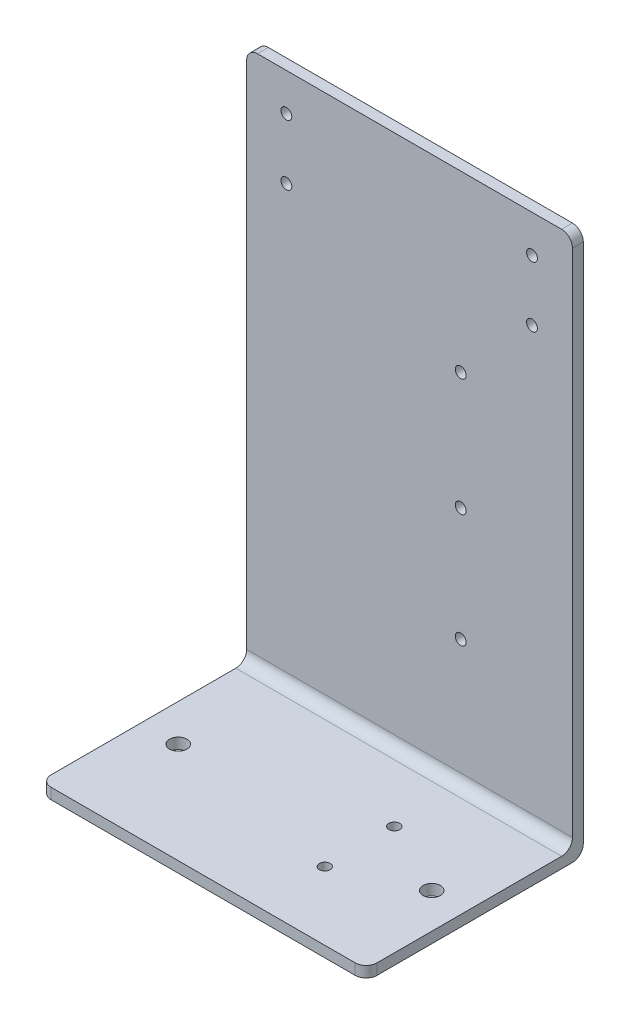
ISO-10303-21;
HEADER;
FILE_DESCRIPTION(('STEP AP214'),'2;1');
FILE_NAME('part.step','',(''),(''),'','','');
FILE_SCHEMA(('AUTOMOTIVE_DESIGN { 1 0 10303 214 1 1 1 1 }'));
ENDSEC;
DATA;
#1=APPLICATION_CONTEXT('core data for automotive mechanical design processes');
#2=APPLICATION_PROTOCOL_DEFINITION('international standard','automotive_design',2000,#1);
#3=PRODUCT_CONTEXT('',#1,'mechanical');
#4=PRODUCT('Part','Part','',(#3));
#5=PRODUCT_RELATED_PRODUCT_CATEGORY('part','',(#4));
#6=PRODUCT_DEFINITION_FORMATION('','',#4);
#7=PRODUCT_DEFINITION_CONTEXT('part definition',#1,'design');
#8=PRODUCT_DEFINITION('design','',#6,#7);
#9=PRODUCT_DEFINITION_SHAPE('','',#8);
#10=(LENGTH_UNIT() NAMED_UNIT(*) SI_UNIT(.MILLI.,.METRE.));
#11=(NAMED_UNIT(*) PLANE_ANGLE_UNIT() SI_UNIT($,.RADIAN.));
#12=(NAMED_UNIT(*) SI_UNIT($,.STERADIAN.) SOLID_ANGLE_UNIT());
#13=UNCERTAINTY_MEASURE_WITH_UNIT(LENGTH_MEASURE(1.E-05),#10,'distance_accuracy_value','');
#14=(GEOMETRIC_REPRESENTATION_CONTEXT(3) GLOBAL_UNCERTAINTY_ASSIGNED_CONTEXT((#13)) GLOBAL_UNIT_ASSIGNED_CONTEXT((#10,
#11,#12)) REPRESENTATION_CONTEXT('',''));
#15=CARTESIAN_POINT('',(0.,0.,0.));
#16=DIRECTION('',(0.,0.,1.));
#17=DIRECTION('',(1.,0.,0.));
#18=AXIS2_PLACEMENT_3D('',#15,#16,#17);
#19=CARTESIAN_POINT('',(-300.,10.,0.));
#20=DIRECTION('',(0.,-1.,0.));
#21=DIRECTION('',(0.,0.,-1.));
#22=AXIS2_PLACEMENT_3D('',#19,#20,#21);
#23=PLANE('',#22);
#24=CARTESIAN_POINT('',(-32.5315013173715,10.,107.072710653668));
#25=DIRECTION('',(0.,1.,0.));
#26=DIRECTION('',(0.,0.,1.));
#27=AXIS2_PLACEMENT_3D('',#24,#25,#26);
#28=CIRCLE('',#27,8.);
#29=CARTESIAN_POINT('',(-32.5315013173715,10.,115.072710653668));
#30=VERTEX_POINT('',#29);
#31=EDGE_CURVE('E426',#30,#30,#28,.T.);
#32=ORIENTED_EDGE('',*,*,#31,.F.);
#33=EDGE_LOOP('',(#32));
#34=FACE_BOUND('',#33,.T.);
#35=CARTESIAN_POINT('',(-100.798534583192,10.,73.2467031796124));
#36=DIRECTION('',(0.,-1.,0.));
#37=DIRECTION('',(0.,0.,-1.));
#38=AXIS2_PLACEMENT_3D('',#35,#36,#37);
#39=CIRCLE('',#38,4.99999999999999);
#40=CARTESIAN_POINT('',(-100.798534583192,10.,68.2467031796124));
#41=VERTEX_POINT('',#40);
#42=EDGE_CURVE('E50',#41,#41,#39,.T.);
#43=ORIENTED_EDGE('',*,*,#42,.T.);
#44=EDGE_LOOP('',(#43));
#45=FACE_BOUND('',#44,.T.);
#46=CARTESIAN_POINT('',(-100.798534583192,10.,137.208608221462));
#47=DIRECTION('',(0.,-1.,0.));
#48=DIRECTION('',(0.,0.,-1.));
#49=AXIS2_PLACEMENT_3D('',#46,#47,#48);
#50=CIRCLE('',#49,4.99999999999999);
#51=CARTESIAN_POINT('',(-100.798534583192,10.,132.208608221462));
#52=VERTEX_POINT('',#51);
#53=EDGE_CURVE('E237',#52,#52,#50,.T.);
#54=ORIENTED_EDGE('',*,*,#53,.T.);
#55=EDGE_LOOP('',(#54));
#56=FACE_BOUND('',#55,.T.);
#57=DIRECTION('',(0.,0.,-1.));
#58=VECTOR('',#57,1.);
#59=CARTESIAN_POINT('',(0.,10.,0.));
#60=LINE('',#59,#58);
#61=CARTESIAN_POINT('',(0.,10.,190.));
#62=VERTEX_POINT('',#61);
#63=CARTESIAN_POINT('',(0.,10.,20.));
#64=VERTEX_POINT('',#63);
#65=EDGE_CURVE('E168',#62,#64,#60,.T.);
#66=ORIENTED_EDGE('',*,*,#65,.T.);
#67=DIRECTION('',(1.,0.,0.));
#68=VECTOR('',#67,1.);
#69=CARTESIAN_POINT('',(-300.,10.,20.));
#70=LINE('',#69,#68);
#71=CARTESIAN_POINT('',(-300.,10.,20.));
#72=VERTEX_POINT('',#71);
#73=EDGE_CURVE('E143',#64,#72,#70,.F.);
#74=ORIENTED_EDGE('',*,*,#73,.T.);
#75=DIRECTION('',(0.,0.,-1.));
#76=VECTOR('',#75,1.);
#77=CARTESIAN_POINT('',(-300.,10.,0.));
#78=LINE('',#77,#76);
#79=CARTESIAN_POINT('',(-300.,10.,190.));
#80=VERTEX_POINT('',#79);
#81=EDGE_CURVE('E295',#80,#72,#78,.T.);
#82=ORIENTED_EDGE('',*,*,#81,.F.);
#83=CARTESIAN_POINT('',(-290.,10.,190.));
#84=DIRECTION('',(0.,-1.,0.));
#85=DIRECTION('',(0.,0.,-1.));
#86=AXIS2_PLACEMENT_3D('',#83,#84,#85);
#87=CIRCLE('',#86,10.);
#88=CARTESIAN_POINT('',(-290.,10.,200.));
#89=VERTEX_POINT('',#88);
#90=EDGE_CURVE('E202',#80,#89,#87,.F.);
#91=ORIENTED_EDGE('',*,*,#90,.T.);
#92=DIRECTION('',(1.,0.,0.));
#93=VECTOR('',#92,1.);
#94=CARTESIAN_POINT('',(-300.,10.,200.));
#95=LINE('',#94,#93);
#96=CARTESIAN_POINT('',(-10.,10.,200.));
#97=VERTEX_POINT('',#96);
#98=EDGE_CURVE('E186',#89,#97,#95,.T.);
#99=ORIENTED_EDGE('',*,*,#98,.T.);
#100=CARTESIAN_POINT('',(-10.,10.,190.));
#101=DIRECTION('',(0.,-1.,0.));
#102=DIRECTION('',(0.,0.,-1.));
#103=AXIS2_PLACEMENT_3D('',#100,#101,#102);
#104=CIRCLE('',#103,10.);
#105=EDGE_CURVE('E158',#97,#62,#104,.F.);
#106=ORIENTED_EDGE('',*,*,#105,.T.);
#107=EDGE_LOOP('',(#66,#74,#82,#91,#99,#106));
#108=FACE_BOUND('',#107,.T.);
#109=CARTESIAN_POINT('',(-265.930952888353,10.,107.072710653668));
#110=DIRECTION('',(0.,1.,0.));
#111=DIRECTION('',(0.,0.,1.));
#112=AXIS2_PLACEMENT_3D('',#109,#110,#111);
#113=CIRCLE('',#112,8.00000000000001);
#114=CARTESIAN_POINT('',(-265.930952888353,10.,115.072710653668));
#115=VERTEX_POINT('',#114);
#116=EDGE_CURVE('E428',#115,#115,#113,.T.);
#117=ORIENTED_EDGE('',*,*,#116,.F.);
#118=EDGE_LOOP('',(#117));
#119=FACE_BOUND('',#118,.T.);
#120=ADVANCED_FACE('F46',(#34,#45,#56,#108,#119),#23,.F.);
#121=CARTESIAN_POINT('',(-300.,10.,10.));
#122=DIRECTION('',(1.,0.,0.));
#123=DIRECTION('',(0.,0.,-1.));
#124=AXIS2_PLACEMENT_3D('',#121,#122,#123);
#125=CYLINDRICAL_SURFACE('',#124,10.);
#126=CARTESIAN_POINT('',(-300.,10.,10.));
#127=DIRECTION('',(1.,0.,0.));
#128=DIRECTION('',(0.,0.,-1.));
#129=AXIS2_PLACEMENT_3D('',#126,#127,#128);
#130=CIRCLE('',#129,10.);
#131=CARTESIAN_POINT('',(-300.,10.,0.));
#132=VERTEX_POINT('',#131);
#133=CARTESIAN_POINT('',(-300.,0.,10.));
#134=VERTEX_POINT('',#133);
#135=EDGE_CURVE('E228',#132,#134,#130,.F.);
#136=ORIENTED_EDGE('',*,*,#135,.F.);
#137=DIRECTION('',(1.,0.,0.));
#138=VECTOR('',#137,1.);
#139=CARTESIAN_POINT('',(-300.,10.,0.));
#140=LINE('',#139,#138);
#141=CARTESIAN_POINT('',(0.,10.,0.));
#142=VERTEX_POINT('',#141);
#143=EDGE_CURVE('E221',#142,#132,#140,.F.);
#144=ORIENTED_EDGE('',*,*,#143,.F.);
#145=CARTESIAN_POINT('',(0.,10.,10.));
#146=DIRECTION('',(1.,0.,0.));
#147=DIRECTION('',(0.,0.,-1.));
#148=AXIS2_PLACEMENT_3D('',#145,#146,#147);
#149=CIRCLE('',#148,10.);
#150=CARTESIAN_POINT('',(0.,0.,10.));
#151=VERTEX_POINT('',#150);
#152=EDGE_CURVE('E216',#151,#142,#149,.T.);
#153=ORIENTED_EDGE('',*,*,#152,.F.);
#154=DIRECTION('',(1.,0.,0.));
#155=VECTOR('',#154,1.);
#156=CARTESIAN_POINT('',(-300.,0.,10.));
#157=LINE('',#156,#155);
#158=EDGE_CURVE('E210',#134,#151,#157,.T.);
#159=ORIENTED_EDGE('',*,*,#158,.F.);
#160=EDGE_LOOP('',(#136,#144,#153,#159));
#161=FACE_BOUND('',#160,.T.);
#162=ADVANCED_FACE('F310',(#161),#125,.T.);
#163=CARTESIAN_POINT('',(-300.,0.,200.));
#164=DIRECTION('',(0.,0.,-1.));
#165=DIRECTION('',(-1.,0.,0.));
#166=AXIS2_PLACEMENT_3D('',#163,#164,#165);
#167=PLANE('',#166);
#168=ORIENTED_EDGE('',*,*,#98,.F.);
#169=DIRECTION('',(0.,1.,0.));
#170=VECTOR('',#169,1.);
#171=CARTESIAN_POINT('',(-290.,0.,200.));
#172=LINE('',#171,#170);
#173=CARTESIAN_POINT('',(-290.,0.,200.));
#174=VERTEX_POINT('',#173);
#175=EDGE_CURVE('E233',#89,#174,#172,.F.);
#176=ORIENTED_EDGE('',*,*,#175,.T.);
#177=DIRECTION('',(1.,0.,0.));
#178=VECTOR('',#177,1.);
#179=CARTESIAN_POINT('',(-300.,0.,200.));
#180=LINE('',#179,#178);
#181=CARTESIAN_POINT('',(-10.,0.,200.));
#182=VERTEX_POINT('',#181);
#183=EDGE_CURVE('E182',#174,#182,#180,.T.);
#184=ORIENTED_EDGE('',*,*,#183,.T.);
#185=DIRECTION('',(0.,1.,0.));
#186=VECTOR('',#185,1.);
#187=CARTESIAN_POINT('',(-10.,10.,200.));
#188=LINE('',#187,#186);
#189=EDGE_CURVE('E230',#182,#97,#188,.T.);
#190=ORIENTED_EDGE('',*,*,#189,.T.);
#191=EDGE_LOOP('',(#168,#176,#184,#190));
#192=FACE_BOUND('',#191,.T.);
#193=ADVANCED_FACE('F334',(#192),#167,.F.);
#194=CARTESIAN_POINT('',(-300.,0.,0.));
#195=DIRECTION('',(1.,0.,0.));
#196=DIRECTION('',(0.,0.,-1.));
#197=AXIS2_PLACEMENT_3D('',#194,#195,#196);
#198=PLANE('',#197);
#199=DIRECTION('',(0.,1.,0.));
#200=VECTOR('',#199,1.);
#201=CARTESIAN_POINT('',(-300.,0.,0.));
#202=LINE('',#201,#200);
#203=CARTESIAN_POINT('',(-300.,490.,0.));
#204=VERTEX_POINT('',#203);
#205=EDGE_CURVE('E181',#132,#204,#202,.T.);
#206=ORIENTED_EDGE('',*,*,#205,.F.);
#207=ORIENTED_EDGE('',*,*,#135,.T.);
#208=DIRECTION('',(0.,0.,-1.));
#209=VECTOR('',#208,1.);
#210=CARTESIAN_POINT('',(-300.,0.,0.));
#211=LINE('',#210,#209);
#212=CARTESIAN_POINT('',(-300.,0.,190.));
#213=VERTEX_POINT('',#212);
#214=EDGE_CURVE('E195',#213,#134,#211,.T.);
#215=ORIENTED_EDGE('',*,*,#214,.F.);
#216=DIRECTION('',(0.,1.,0.));
#217=VECTOR('',#216,1.);
#218=CARTESIAN_POINT('',(-300.,0.,190.));
#219=LINE('',#218,#217);
#220=EDGE_CURVE('E225',#213,#80,#219,.T.);
#221=ORIENTED_EDGE('',*,*,#220,.T.);
#222=ORIENTED_EDGE('',*,*,#81,.T.);
#223=CARTESIAN_POINT('',(-300.,20.,20.));
#224=DIRECTION('',(1.,0.,0.));
#225=DIRECTION('',(0.,0.,-1.));
#226=AXIS2_PLACEMENT_3D('',#223,#224,#225);
#227=CIRCLE('',#226,10.);
#228=CARTESIAN_POINT('',(-300.,20.,10.));
#229=VERTEX_POINT('',#228);
#230=EDGE_CURVE('E11',#72,#229,#227,.T.);
#231=ORIENTED_EDGE('',*,*,#230,.T.);
#232=DIRECTION('',(0.,1.,0.));
#233=VECTOR('',#232,1.);
#234=CARTESIAN_POINT('',(-300.,0.,10.));
#235=LINE('',#234,#233);
#236=CARTESIAN_POINT('',(-300.,490.,10.));
#237=VERTEX_POINT('',#236);
#238=EDGE_CURVE('E157',#229,#237,#235,.T.);
#239=ORIENTED_EDGE('',*,*,#238,.T.);
#240=DIRECTION('',(0.,0.,1.));
#241=VECTOR('',#240,1.);
#242=CARTESIAN_POINT('',(-300.,490.,0.));
#243=LINE('',#242,#241);
#244=EDGE_CURVE('E223',#237,#204,#243,.F.);
#245=ORIENTED_EDGE('',*,*,#244,.T.);
#246=EDGE_LOOP('',(#206,#207,#215,#221,#222,#231,#239,#245));
#247=FACE_BOUND('',#246,.T.);
#248=ADVANCED_FACE('F323',(#247),#198,.F.);
#249=CARTESIAN_POINT('',(0.,0.,0.));
#250=DIRECTION('',(1.,0.,0.));
#251=DIRECTION('',(0.,0.,-1.));
#252=AXIS2_PLACEMENT_3D('',#249,#250,#251);
#253=PLANE('',#252);
#254=DIRECTION('',(0.,0.,-1.));
#255=VECTOR('',#254,1.);
#256=CARTESIAN_POINT('',(0.,0.,0.));
#257=LINE('',#256,#255);
#258=CARTESIAN_POINT('',(0.,0.,190.));
#259=VERTEX_POINT('',#258);
#260=EDGE_CURVE('E174',#259,#151,#257,.T.);
#261=ORIENTED_EDGE('',*,*,#260,.T.);
#262=ORIENTED_EDGE('',*,*,#152,.T.);
#263=DIRECTION('',(0.,1.,0.));
#264=VECTOR('',#263,1.);
#265=CARTESIAN_POINT('',(0.,0.,0.));
#266=LINE('',#265,#264);
#267=CARTESIAN_POINT('',(0.,490.,0.));
#268=VERTEX_POINT('',#267);
#269=EDGE_CURVE('E169',#142,#268,#266,.T.);
#270=ORIENTED_EDGE('',*,*,#269,.T.);
#271=DIRECTION('',(0.,0.,1.));
#272=VECTOR('',#271,1.);
#273=CARTESIAN_POINT('',(0.,490.,0.));
#274=LINE('',#273,#272);
#275=CARTESIAN_POINT('',(0.,490.,10.));
#276=VERTEX_POINT('',#275);
#277=EDGE_CURVE('E166',#268,#276,#274,.T.);
#278=ORIENTED_EDGE('',*,*,#277,.T.);
#279=DIRECTION('',(0.,1.,0.));
#280=VECTOR('',#279,1.);
#281=CARTESIAN_POINT('',(0.,0.,10.));
#282=LINE('',#281,#280);
#283=CARTESIAN_POINT('',(0.,20.,10.));
#284=VERTEX_POINT('',#283);
#285=EDGE_CURVE('E155',#284,#276,#282,.T.);
#286=ORIENTED_EDGE('',*,*,#285,.F.);
#287=CARTESIAN_POINT('',(0.,20.,20.));
#288=DIRECTION('',(1.,0.,0.));
#289=DIRECTION('',(0.,0.,-1.));
#290=AXIS2_PLACEMENT_3D('',#287,#288,#289);
#291=CIRCLE('',#290,10.);
#292=EDGE_CURVE('E56',#284,#64,#291,.F.);
#293=ORIENTED_EDGE('',*,*,#292,.T.);
#294=ORIENTED_EDGE('',*,*,#65,.F.);
#295=DIRECTION('',(0.,1.,0.));
#296=VECTOR('',#295,1.);
#297=CARTESIAN_POINT('',(0.,0.,190.));
#298=LINE('',#297,#296);
#299=EDGE_CURVE('E214',#62,#259,#298,.F.);
#300=ORIENTED_EDGE('',*,*,#299,.T.);
#301=EDGE_LOOP('',(#261,#262,#270,#278,#286,#293,#294,#300));
#302=FACE_BOUND('',#301,.T.);
#303=ADVANCED_FACE('F163',(#302),#253,.T.);
#304=CARTESIAN_POINT('',(-300.,500.,0.));
#305=DIRECTION('',(0.,1.,0.));
#306=DIRECTION('',(0.,0.,1.));
#307=AXIS2_PLACEMENT_3D('',#304,#305,#306);
#308=PLANE('',#307);
#309=DIRECTION('',(1.,0.,0.));
#310=VECTOR('',#309,1.);
#311=CARTESIAN_POINT('',(-300.,500.,0.));
#312=LINE('',#311,#310);
#313=CARTESIAN_POINT('',(-290.,500.,0.));
#314=VERTEX_POINT('',#313);
#315=CARTESIAN_POINT('',(-10.,500.,0.));
#316=VERTEX_POINT('',#315);
#317=EDGE_CURVE('E193',#314,#316,#312,.T.);
#318=ORIENTED_EDGE('',*,*,#317,.F.);
#319=DIRECTION('',(0.,0.,1.));
#320=VECTOR('',#319,1.);
#321=CARTESIAN_POINT('',(-290.,500.,10.));
#322=LINE('',#321,#320);
#323=CARTESIAN_POINT('',(-290.,500.,10.));
#324=VERTEX_POINT('',#323);
#325=EDGE_CURVE('E149',#314,#324,#322,.T.);
#326=ORIENTED_EDGE('',*,*,#325,.T.);
#327=DIRECTION('',(1.,0.,0.));
#328=VECTOR('',#327,1.);
#329=CARTESIAN_POINT('',(-300.,500.,10.));
#330=LINE('',#329,#328);
#331=CARTESIAN_POINT('',(-10.,500.,10.));
#332=VERTEX_POINT('',#331);
#333=EDGE_CURVE('E190',#324,#332,#330,.T.);
#334=ORIENTED_EDGE('',*,*,#333,.T.);
#335=DIRECTION('',(0.,0.,1.));
#336=VECTOR('',#335,1.);
#337=CARTESIAN_POINT('',(-10.,500.,0.));
#338=LINE('',#337,#336);
#339=EDGE_CURVE('E64',#332,#316,#338,.F.);
#340=ORIENTED_EDGE('',*,*,#339,.T.);
#341=EDGE_LOOP('',(#318,#326,#334,#340));
#342=FACE_BOUND('',#341,.T.);
#343=ADVANCED_FACE('F318',(#342),#308,.T.);
#344=CARTESIAN_POINT('',(-300.,0.,0.));
#345=DIRECTION('',(0.,0.,-1.));
#346=DIRECTION('',(-1.,0.,0.));
#347=AXIS2_PLACEMENT_3D('',#344,#345,#346);
#348=PLANE('',#347);
#349=CARTESIAN_POINT('',(-102.908891555727,339.53943154897,0.));
#350=DIRECTION('',(0.,0.,1.));
#351=DIRECTION('',(1.,0.,0.));
#352=AXIS2_PLACEMENT_3D('',#349,#350,#351);
#353=CIRCLE('',#352,4.99999999999999);
#354=CARTESIAN_POINT('',(-97.908891555727,339.53943154897,0.));
#355=VERTEX_POINT('',#354);
#356=EDGE_CURVE('E239',#355,#355,#353,.T.);
#357=ORIENTED_EDGE('',*,*,#356,.T.);
#358=EDGE_LOOP('',(#357));
#359=FACE_BOUND('',#358,.T.);
#360=CARTESIAN_POINT('',(-102.908891555727,231.428858641695,0.));
#361=DIRECTION('',(0.,0.,1.));
#362=DIRECTION('',(1.,0.,0.));
#363=AXIS2_PLACEMENT_3D('',#360,#361,#362);
#364=CIRCLE('',#363,4.99999999999999);
#365=CARTESIAN_POINT('',(-97.908891555727,231.428858641695,0.));
#366=VERTEX_POINT('',#365);
#367=EDGE_CURVE('E257',#366,#366,#364,.T.);
#368=ORIENTED_EDGE('',*,*,#367,.T.);
#369=EDGE_LOOP('',(#368));
#370=FACE_BOUND('',#369,.T.);
#371=CARTESIAN_POINT('',(-102.908891555727,126.634560976974,0.));
#372=DIRECTION('',(0.,0.,1.));
#373=DIRECTION('',(1.,0.,0.));
#374=AXIS2_PLACEMENT_3D('',#371,#372,#373);
#375=CIRCLE('',#374,4.99999999999999);
#376=CARTESIAN_POINT('',(-97.908891555727,126.634560976974,0.));
#377=VERTEX_POINT('',#376);
#378=EDGE_CURVE('E263',#377,#377,#375,.T.);
#379=ORIENTED_EDGE('',*,*,#378,.T.);
#380=EDGE_LOOP('',(#379));
#381=FACE_BOUND('',#380,.T.);
#382=CARTESIAN_POINT('',(-37.246641753149,465.557890766038,0.));
#383=DIRECTION('',(0.,0.,1.));
#384=DIRECTION('',(1.,0.,0.));
#385=AXIS2_PLACEMENT_3D('',#382,#383,#384);
#386=CIRCLE('',#385,4.99999999999999);
#387=CARTESIAN_POINT('',(-32.246641753149,465.557890766038,0.));
#388=VERTEX_POINT('',#387);
#389=EDGE_CURVE('E269',#388,#388,#386,.T.);
#390=ORIENTED_EDGE('',*,*,#389,.T.);
#391=EDGE_LOOP('',(#390));
#392=FACE_BOUND('',#391,.T.);
#393=CARTESIAN_POINT('',(-37.246641753149,409.844466691124,0.));
#394=DIRECTION('',(0.,0.,1.));
#395=DIRECTION('',(1.,0.,0.));
#396=AXIS2_PLACEMENT_3D('',#393,#394,#395);
#397=CIRCLE('',#396,4.99999999999999);
#398=CARTESIAN_POINT('',(-32.246641753149,409.844466691124,0.));
#399=VERTEX_POINT('',#398);
#400=EDGE_CURVE('E275',#399,#399,#397,.T.);
#401=ORIENTED_EDGE('',*,*,#400,.T.);
#402=EDGE_LOOP('',(#401));
#403=FACE_BOUND('',#402,.T.);
#404=CARTESIAN_POINT('',(-263.416613295362,409.844466691124,0.));
#405=DIRECTION('',(0.,0.,1.));
#406=DIRECTION('',(1.,0.,0.));
#407=AXIS2_PLACEMENT_3D('',#404,#405,#406);
#408=CIRCLE('',#407,5.);
#409=CARTESIAN_POINT('',(-258.416613295362,409.844466691124,0.));
#410=VERTEX_POINT('',#409);
#411=EDGE_CURVE('E281',#410,#410,#408,.T.);
#412=ORIENTED_EDGE('',*,*,#411,.T.);
#413=EDGE_LOOP('',(#412));
#414=FACE_BOUND('',#413,.T.);
#415=CARTESIAN_POINT('',(-263.416613295362,465.557890766038,0.));
#416=DIRECTION('',(0.,0.,1.));
#417=DIRECTION('',(1.,0.,0.));
#418=AXIS2_PLACEMENT_3D('',#415,#416,#417);
#419=CIRCLE('',#418,5.);
#420=CARTESIAN_POINT('',(-258.416613295362,465.557890766038,0.));
#421=VERTEX_POINT('',#420);
#422=EDGE_CURVE('E287',#421,#421,#419,.T.);
#423=ORIENTED_EDGE('',*,*,#422,.T.);
#424=EDGE_LOOP('',(#423));
#425=FACE_BOUND('',#424,.T.);
#426=ORIENTED_EDGE('',*,*,#269,.F.);
#427=ORIENTED_EDGE('',*,*,#143,.T.);
#428=ORIENTED_EDGE('',*,*,#205,.T.);
#429=CARTESIAN_POINT('',(-290.,490.,0.));
#430=DIRECTION('',(0.,0.,-1.));
#431=DIRECTION('',(-1.,0.,0.));
#432=AXIS2_PLACEMENT_3D('',#429,#430,#431);
#433=CIRCLE('',#432,10.);
#434=EDGE_CURVE('E71',#204,#314,#433,.T.);
#435=ORIENTED_EDGE('',*,*,#434,.T.);
#436=ORIENTED_EDGE('',*,*,#317,.T.);
#437=CARTESIAN_POINT('',(-10.,490.,0.));
#438=DIRECTION('',(0.,0.,-1.));
#439=DIRECTION('',(-1.,0.,0.));
#440=AXIS2_PLACEMENT_3D('',#437,#438,#439);
#441=CIRCLE('',#440,10.);
#442=EDGE_CURVE('E218',#316,#268,#441,.T.);
#443=ORIENTED_EDGE('',*,*,#442,.T.);
#444=EDGE_LOOP('',(#426,#427,#428,#435,#436,#443));
#445=FACE_BOUND('',#444,.T.);
#446=ADVANCED_FACE('F313',(#359,#370,#381,#392,#403,#414,#425,#445),#348,.T.);
#447=CARTESIAN_POINT('',(-102.908891555727,339.53943154897,20.));
#448=DIRECTION('',(0.,0.,1.));
#449=DIRECTION('',(1.,0.,0.));
#450=AXIS2_PLACEMENT_3D('',#447,#448,#449);
#451=CYLINDRICAL_SURFACE('',#450,4.99999999999999);
#452=ORIENTED_EDGE('',*,*,#356,.F.);
#453=EDGE_LOOP('',(#452));
#454=FACE_BOUND('',#453,.T.);
#455=CARTESIAN_POINT('',(-102.908891555727,339.53943154897,10.));
#456=DIRECTION('',(0.,0.,-1.));
#457=DIRECTION('',(-1.,0.,0.));
#458=AXIS2_PLACEMENT_3D('',#455,#456,#457);
#459=CIRCLE('',#458,4.99999999999999);
#460=CARTESIAN_POINT('',(-107.908891555727,339.53943154897,10.));
#461=VERTEX_POINT('',#460);
#462=EDGE_CURVE('E244',#461,#461,#459,.T.);
#463=ORIENTED_EDGE('',*,*,#462,.F.);
#464=EDGE_LOOP('',(#463));
#465=FACE_BOUND('',#464,.T.);
#466=ADVANCED_FACE('F365',(#454,#465),#451,.F.);
#467=CARTESIAN_POINT('',(-102.908891555727,231.428858641695,20.));
#468=DIRECTION('',(0.,0.,1.));
#469=DIRECTION('',(1.,0.,0.));
#470=AXIS2_PLACEMENT_3D('',#467,#468,#469);
#471=CYLINDRICAL_SURFACE('',#470,4.99999999999999);
#472=ORIENTED_EDGE('',*,*,#367,.F.);
#473=EDGE_LOOP('',(#472));
#474=FACE_BOUND('',#473,.T.);
#475=CARTESIAN_POINT('',(-102.908891555727,231.428858641695,10.));
#476=DIRECTION('',(0.,0.,-1.));
#477=DIRECTION('',(-1.,0.,0.));
#478=AXIS2_PLACEMENT_3D('',#475,#476,#477);
#479=CIRCLE('',#478,4.99999999999999);
#480=CARTESIAN_POINT('',(-107.908891555727,231.428858641695,10.));
#481=VERTEX_POINT('',#480);
#482=EDGE_CURVE('E260',#481,#481,#479,.T.);
#483=ORIENTED_EDGE('',*,*,#482,.F.);
#484=EDGE_LOOP('',(#483));
#485=FACE_BOUND('',#484,.T.);
#486=ADVANCED_FACE('F396',(#474,#485),#471,.F.);
#487=CARTESIAN_POINT('',(-102.908891555727,126.634560976974,20.));
#488=DIRECTION('',(0.,0.,1.));
#489=DIRECTION('',(1.,0.,0.));
#490=AXIS2_PLACEMENT_3D('',#487,#488,#489);
#491=CYLINDRICAL_SURFACE('',#490,4.99999999999999);
#492=ORIENTED_EDGE('',*,*,#378,.F.);
#493=EDGE_LOOP('',(#492));
#494=FACE_BOUND('',#493,.T.);
#495=CARTESIAN_POINT('',(-102.908891555727,126.634560976974,10.));
#496=DIRECTION('',(0.,0.,-1.));
#497=DIRECTION('',(-1.,0.,0.));
#498=AXIS2_PLACEMENT_3D('',#495,#496,#497);
#499=CIRCLE('',#498,4.99999999999999);
#500=CARTESIAN_POINT('',(-107.908891555727,126.634560976974,10.));
#501=VERTEX_POINT('',#500);
#502=EDGE_CURVE('E266',#501,#501,#499,.T.);
#503=ORIENTED_EDGE('',*,*,#502,.F.);
#504=EDGE_LOOP('',(#503));
#505=FACE_BOUND('',#504,.T.);
#506=ADVANCED_FACE('F392',(#494,#505),#491,.F.);
#507=CARTESIAN_POINT('',(-37.246641753149,465.557890766038,20.));
#508=DIRECTION('',(0.,0.,1.));
#509=DIRECTION('',(1.,0.,0.));
#510=AXIS2_PLACEMENT_3D('',#507,#508,#509);
#511=CYLINDRICAL_SURFACE('',#510,4.99999999999999);
#512=ORIENTED_EDGE('',*,*,#389,.F.);
#513=EDGE_LOOP('',(#512));
#514=FACE_BOUND('',#513,.T.);
#515=CARTESIAN_POINT('',(-37.246641753149,465.557890766038,10.));
#516=DIRECTION('',(0.,0.,-1.));
#517=DIRECTION('',(-1.,0.,0.));
#518=AXIS2_PLACEMENT_3D('',#515,#516,#517);
#519=CIRCLE('',#518,4.99999999999999);
#520=CARTESIAN_POINT('',(-42.2466417531489,465.557890766038,10.));
#521=VERTEX_POINT('',#520);
#522=EDGE_CURVE('E272',#521,#521,#519,.T.);
#523=ORIENTED_EDGE('',*,*,#522,.F.);
#524=EDGE_LOOP('',(#523));
#525=FACE_BOUND('',#524,.T.);
#526=ADVANCED_FACE('F388',(#514,#525),#511,.F.);
#527=CARTESIAN_POINT('',(-37.246641753149,409.844466691124,20.));
#528=DIRECTION('',(0.,0.,1.));
#529=DIRECTION('',(1.,0.,0.));
#530=AXIS2_PLACEMENT_3D('',#527,#528,#529);
#531=CYLINDRICAL_SURFACE('',#530,4.99999999999999);
#532=ORIENTED_EDGE('',*,*,#400,.F.);
#533=EDGE_LOOP('',(#532));
#534=FACE_BOUND('',#533,.T.);
#535=CARTESIAN_POINT('',(-37.246641753149,409.844466691124,10.));
#536=DIRECTION('',(0.,0.,-1.));
#537=DIRECTION('',(-1.,0.,0.));
#538=AXIS2_PLACEMENT_3D('',#535,#536,#537);
#539=CIRCLE('',#538,4.99999999999999);
#540=CARTESIAN_POINT('',(-42.2466417531489,409.844466691124,10.));
#541=VERTEX_POINT('',#540);
#542=EDGE_CURVE('E278',#541,#541,#539,.T.);
#543=ORIENTED_EDGE('',*,*,#542,.F.);
#544=EDGE_LOOP('',(#543));
#545=FACE_BOUND('',#544,.T.);
#546=ADVANCED_FACE('F384',(#534,#545),#531,.F.);
#547=CARTESIAN_POINT('',(-263.416613295362,409.844466691124,20.));
#548=DIRECTION('',(0.,0.,1.));
#549=DIRECTION('',(1.,0.,0.));
#550=AXIS2_PLACEMENT_3D('',#547,#548,#549);
#551=CYLINDRICAL_SURFACE('',#550,5.);
#552=ORIENTED_EDGE('',*,*,#411,.F.);
#553=EDGE_LOOP('',(#552));
#554=FACE_BOUND('',#553,.T.);
#555=CARTESIAN_POINT('',(-263.416613295362,409.844466691124,10.));
#556=DIRECTION('',(0.,0.,-1.));
#557=DIRECTION('',(-1.,0.,0.));
#558=AXIS2_PLACEMENT_3D('',#555,#556,#557);
#559=CIRCLE('',#558,5.);
#560=CARTESIAN_POINT('',(-268.416613295362,409.844466691124,10.));
#561=VERTEX_POINT('',#560);
#562=EDGE_CURVE('E284',#561,#561,#559,.T.);
#563=ORIENTED_EDGE('',*,*,#562,.F.);
#564=EDGE_LOOP('',(#563));
#565=FACE_BOUND('',#564,.T.);
#566=ADVANCED_FACE('F380',(#554,#565),#551,.F.);
#567=CARTESIAN_POINT('',(-263.416613295362,465.557890766038,20.));
#568=DIRECTION('',(0.,0.,1.));
#569=DIRECTION('',(1.,0.,0.));
#570=AXIS2_PLACEMENT_3D('',#567,#568,#569);
#571=CYLINDRICAL_SURFACE('',#570,5.);
#572=ORIENTED_EDGE('',*,*,#422,.F.);
#573=EDGE_LOOP('',(#572));
#574=FACE_BOUND('',#573,.T.);
#575=CARTESIAN_POINT('',(-263.416613295362,465.557890766038,10.));
#576=DIRECTION('',(0.,0.,-1.));
#577=DIRECTION('',(-1.,0.,0.));
#578=AXIS2_PLACEMENT_3D('',#575,#576,#577);
#579=CIRCLE('',#578,5.);
#580=CARTESIAN_POINT('',(-268.416613295362,465.557890766038,10.));
#581=VERTEX_POINT('',#580);
#582=EDGE_CURVE('E176',#581,#581,#579,.T.);
#583=ORIENTED_EDGE('',*,*,#582,.F.);
#584=EDGE_LOOP('',(#583));
#585=FACE_BOUND('',#584,.T.);
#586=ADVANCED_FACE('F377',(#574,#585),#571,.F.);
#587=CARTESIAN_POINT('',(-10.,490.,0.));
#588=DIRECTION('',(0.,0.,1.));
#589=DIRECTION('',(1.,0.,0.));
#590=AXIS2_PLACEMENT_3D('',#587,#588,#589);
#591=CYLINDRICAL_SURFACE('',#590,10.);
#592=ORIENTED_EDGE('',*,*,#442,.F.);
#593=ORIENTED_EDGE('',*,*,#339,.F.);
#594=CARTESIAN_POINT('',(-10.,490.,10.));
#595=DIRECTION('',(0.,0.,-1.));
#596=DIRECTION('',(-1.,0.,0.));
#597=AXIS2_PLACEMENT_3D('',#594,#595,#596);
#598=CIRCLE('',#597,10.);
#599=EDGE_CURVE('E185',#276,#332,#598,.F.);
#600=ORIENTED_EDGE('',*,*,#599,.F.);
#601=ORIENTED_EDGE('',*,*,#277,.F.);
#602=EDGE_LOOP('',(#592,#593,#600,#601));
#603=FACE_BOUND('',#602,.T.);
#604=ADVANCED_FACE('F48',(#603),#591,.T.);
#605=CARTESIAN_POINT('',(-290.,490.,0.));
#606=DIRECTION('',(0.,0.,-1.));
#607=DIRECTION('',(-1.,0.,0.));
#608=AXIS2_PLACEMENT_3D('',#605,#606,#607);
#609=CYLINDRICAL_SURFACE('',#608,10.);
#610=ORIENTED_EDGE('',*,*,#434,.F.);
#611=ORIENTED_EDGE('',*,*,#244,.F.);
#612=CARTESIAN_POINT('',(-290.,490.,10.));
#613=DIRECTION('',(0.,0.,-1.));
#614=DIRECTION('',(-1.,0.,0.));
#615=AXIS2_PLACEMENT_3D('',#612,#613,#614);
#616=CIRCLE('',#615,10.);
#617=EDGE_CURVE('E159',#324,#237,#616,.F.);
#618=ORIENTED_EDGE('',*,*,#617,.F.);
#619=ORIENTED_EDGE('',*,*,#325,.F.);
#620=EDGE_LOOP('',(#610,#611,#618,#619));
#621=FACE_BOUND('',#620,.T.);
#622=ADVANCED_FACE('F321',(#621),#609,.T.);
#623=CARTESIAN_POINT('',(-300.,0.,0.));
#624=DIRECTION('',(0.,-1.,0.));
#625=DIRECTION('',(0.,0.,-1.));
#626=AXIS2_PLACEMENT_3D('',#623,#624,#625);
#627=PLANE('',#626);
#628=CARTESIAN_POINT('',(-32.5315013173715,0.,107.072710653668));
#629=DIRECTION('',(0.,1.,0.));
#630=DIRECTION('',(0.,0.,1.));
#631=AXIS2_PLACEMENT_3D('',#628,#629,#630);
#632=CIRCLE('',#631,8.);
#633=CARTESIAN_POINT('',(-32.5315013173715,0.,115.072710653668));
#634=VERTEX_POINT('',#633);
#635=EDGE_CURVE('E423',#634,#634,#632,.T.);
#636=ORIENTED_EDGE('',*,*,#635,.T.);
#637=EDGE_LOOP('',(#636));
#638=FACE_BOUND('',#637,.T.);
#639=CARTESIAN_POINT('',(-265.930952888353,0.,107.072710653668));
#640=DIRECTION('',(0.,1.,0.));
#641=DIRECTION('',(0.,0.,1.));
#642=AXIS2_PLACEMENT_3D('',#639,#640,#641);
#643=CIRCLE('',#642,8.00000000000001);
#644=CARTESIAN_POINT('',(-265.930952888353,0.,115.072710653668));
#645=VERTEX_POINT('',#644);
#646=EDGE_CURVE('E432',#645,#645,#643,.T.);
#647=ORIENTED_EDGE('',*,*,#646,.T.);
#648=EDGE_LOOP('',(#647));
#649=FACE_BOUND('',#648,.T.);
#650=CARTESIAN_POINT('',(-100.798534583192,0.,73.2467031796124));
#651=DIRECTION('',(0.,1.,0.));
#652=DIRECTION('',(0.,0.,1.));
#653=AXIS2_PLACEMENT_3D('',#650,#651,#652);
#654=CIRCLE('',#653,4.99999999999999);
#655=CARTESIAN_POINT('',(-100.798534583192,0.,78.2467031796124));
#656=VERTEX_POINT('',#655);
#657=EDGE_CURVE('E251',#656,#656,#654,.T.);
#658=ORIENTED_EDGE('',*,*,#657,.T.);
#659=EDGE_LOOP('',(#658));
#660=FACE_BOUND('',#659,.T.);
#661=CARTESIAN_POINT('',(-100.798534583192,0.,137.208608221462));
#662=DIRECTION('',(0.,1.,0.));
#663=DIRECTION('',(0.,0.,1.));
#664=AXIS2_PLACEMENT_3D('',#661,#662,#663);
#665=CIRCLE('',#664,4.99999999999999);
#666=CARTESIAN_POINT('',(-100.798534583192,0.,142.208608221462));
#667=VERTEX_POINT('',#666);
#668=EDGE_CURVE('E240',#667,#667,#665,.T.);
#669=ORIENTED_EDGE('',*,*,#668,.T.);
#670=EDGE_LOOP('',(#669));
#671=FACE_BOUND('',#670,.T.);
#672=ORIENTED_EDGE('',*,*,#214,.T.);
#673=ORIENTED_EDGE('',*,*,#158,.T.);
#674=ORIENTED_EDGE('',*,*,#260,.F.);
#675=CARTESIAN_POINT('',(-10.,0.,190.));
#676=DIRECTION('',(0.,-1.,0.));
#677=DIRECTION('',(0.,0.,-1.));
#678=AXIS2_PLACEMENT_3D('',#675,#676,#677);
#679=CIRCLE('',#678,10.);
#680=EDGE_CURVE('E206',#259,#182,#679,.T.);
#681=ORIENTED_EDGE('',*,*,#680,.T.);
#682=ORIENTED_EDGE('',*,*,#183,.F.);
#683=CARTESIAN_POINT('',(-290.,0.,190.));
#684=DIRECTION('',(0.,-1.,0.));
#685=DIRECTION('',(0.,0.,-1.));
#686=AXIS2_PLACEMENT_3D('',#683,#684,#685);
#687=CIRCLE('',#686,10.);
#688=EDGE_CURVE('E208',#174,#213,#687,.T.);
#689=ORIENTED_EDGE('',*,*,#688,.T.);
#690=EDGE_LOOP('',(#672,#673,#674,#681,#682,#689));
#691=FACE_BOUND('',#690,.T.);
#692=ADVANCED_FACE('F302',(#638,#649,#660,#671,#691),#627,.T.);
#693=CARTESIAN_POINT('',(-32.5315013173715,10.,107.072710653668));
#694=DIRECTION('',(0.,1.,0.));
#695=DIRECTION('',(0.,0.,1.));
#696=AXIS2_PLACEMENT_3D('',#693,#694,#695);
#697=CYLINDRICAL_SURFACE('',#696,8.);
#698=ORIENTED_EDGE('',*,*,#635,.F.);
#699=EDGE_LOOP('',(#698));
#700=FACE_BOUND('',#699,.T.);
#701=ORIENTED_EDGE('',*,*,#31,.T.);
#702=EDGE_LOOP('',(#701));
#703=FACE_BOUND('',#702,.T.);
#704=ADVANCED_FACE('F371',(#700,#703),#697,.F.);
#705=CARTESIAN_POINT('',(-265.930952888353,10.,107.072710653668));
#706=DIRECTION('',(0.,1.,0.));
#707=DIRECTION('',(0.,0.,1.));
#708=AXIS2_PLACEMENT_3D('',#705,#706,#707);
#709=CYLINDRICAL_SURFACE('',#708,8.00000000000001);
#710=ORIENTED_EDGE('',*,*,#646,.F.);
#711=EDGE_LOOP('',(#710));
#712=FACE_BOUND('',#711,.T.);
#713=ORIENTED_EDGE('',*,*,#116,.T.);
#714=EDGE_LOOP('',(#713));
#715=FACE_BOUND('',#714,.T.);
#716=ADVANCED_FACE('F410',(#712,#715),#709,.F.);
#717=CARTESIAN_POINT('',(-100.798534583192,20.,73.2467031796124));
#718=DIRECTION('',(0.,1.,0.));
#719=DIRECTION('',(0.,0.,1.));
#720=AXIS2_PLACEMENT_3D('',#717,#718,#719);
#721=CYLINDRICAL_SURFACE('',#720,4.99999999999999);
#722=ORIENTED_EDGE('',*,*,#657,.F.);
#723=EDGE_LOOP('',(#722));
#724=FACE_BOUND('',#723,.T.);
#725=ORIENTED_EDGE('',*,*,#42,.F.);
#726=EDGE_LOOP('',(#725));
#727=FACE_BOUND('',#726,.T.);
#728=ADVANCED_FACE('F406',(#724,#727),#721,.F.);
#729=CARTESIAN_POINT('',(-100.798534583192,20.,137.208608221462));
#730=DIRECTION('',(0.,1.,0.));
#731=DIRECTION('',(0.,0.,1.));
#732=AXIS2_PLACEMENT_3D('',#729,#730,#731);
#733=CYLINDRICAL_SURFACE('',#732,4.99999999999999);
#734=ORIENTED_EDGE('',*,*,#668,.F.);
#735=EDGE_LOOP('',(#734));
#736=FACE_BOUND('',#735,.T.);
#737=ORIENTED_EDGE('',*,*,#53,.F.);
#738=EDGE_LOOP('',(#737));
#739=FACE_BOUND('',#738,.T.);
#740=ADVANCED_FACE('F346',(#736,#739),#733,.F.);
#741=CARTESIAN_POINT('',(-10.,0.,190.));
#742=DIRECTION('',(0.,-1.,0.));
#743=DIRECTION('',(0.,0.,-1.));
#744=AXIS2_PLACEMENT_3D('',#741,#742,#743);
#745=CYLINDRICAL_SURFACE('',#744,10.);
#746=ORIENTED_EDGE('',*,*,#680,.F.);
#747=ORIENTED_EDGE('',*,*,#299,.F.);
#748=ORIENTED_EDGE('',*,*,#105,.F.);
#749=ORIENTED_EDGE('',*,*,#189,.F.);
#750=EDGE_LOOP('',(#746,#747,#748,#749));
#751=FACE_BOUND('',#750,.T.);
#752=ADVANCED_FACE('F331',(#751),#745,.T.);
#753=CARTESIAN_POINT('',(-290.,0.,190.));
#754=DIRECTION('',(0.,1.,0.));
#755=DIRECTION('',(0.,0.,1.));
#756=AXIS2_PLACEMENT_3D('',#753,#754,#755);
#757=CYLINDRICAL_SURFACE('',#756,10.);
#758=ORIENTED_EDGE('',*,*,#688,.F.);
#759=ORIENTED_EDGE('',*,*,#175,.F.);
#760=ORIENTED_EDGE('',*,*,#90,.F.);
#761=ORIENTED_EDGE('',*,*,#220,.F.);
#762=EDGE_LOOP('',(#758,#759,#760,#761));
#763=FACE_BOUND('',#762,.T.);
#764=ADVANCED_FACE('F337',(#763),#757,.T.);
#765=CARTESIAN_POINT('',(-300.,0.,10.));
#766=DIRECTION('',(0.,0.,-1.));
#767=DIRECTION('',(-1.,0.,0.));
#768=AXIS2_PLACEMENT_3D('',#765,#766,#767);
#769=PLANE('',#768);
#770=ORIENTED_EDGE('',*,*,#462,.T.);
#771=EDGE_LOOP('',(#770));
#772=FACE_BOUND('',#771,.T.);
#773=ORIENTED_EDGE('',*,*,#482,.T.);
#774=EDGE_LOOP('',(#773));
#775=FACE_BOUND('',#774,.T.);
#776=ORIENTED_EDGE('',*,*,#502,.T.);
#777=EDGE_LOOP('',(#776));
#778=FACE_BOUND('',#777,.T.);
#779=ORIENTED_EDGE('',*,*,#522,.T.);
#780=EDGE_LOOP('',(#779));
#781=FACE_BOUND('',#780,.T.);
#782=ORIENTED_EDGE('',*,*,#542,.T.);
#783=EDGE_LOOP('',(#782));
#784=FACE_BOUND('',#783,.T.);
#785=ORIENTED_EDGE('',*,*,#562,.T.);
#786=EDGE_LOOP('',(#785));
#787=FACE_BOUND('',#786,.T.);
#788=ORIENTED_EDGE('',*,*,#582,.T.);
#789=EDGE_LOOP('',(#788));
#790=FACE_BOUND('',#789,.T.);
#791=ORIENTED_EDGE('',*,*,#238,.F.);
#792=DIRECTION('',(1.,0.,0.));
#793=VECTOR('',#792,1.);
#794=CARTESIAN_POINT('',(0.,20.,10.));
#795=LINE('',#794,#793);
#796=EDGE_CURVE('E142',#229,#284,#795,.T.);
#797=ORIENTED_EDGE('',*,*,#796,.T.);
#798=ORIENTED_EDGE('',*,*,#285,.T.);
#799=ORIENTED_EDGE('',*,*,#599,.T.);
#800=ORIENTED_EDGE('',*,*,#333,.F.);
#801=ORIENTED_EDGE('',*,*,#617,.T.);
#802=EDGE_LOOP('',(#791,#797,#798,#799,#800,#801));
#803=FACE_BOUND('',#802,.T.);
#804=ADVANCED_FACE('F154',(#772,#775,#778,#781,#784,#787,#790,#803),#769,.F.);
#805=CARTESIAN_POINT('',(-300.,20.,20.));
#806=DIRECTION('',(-1.,0.,0.));
#807=DIRECTION('',(0.,0.,1.));
#808=AXIS2_PLACEMENT_3D('',#805,#806,#807);
#809=CYLINDRICAL_SURFACE('',#808,10.);
#810=ORIENTED_EDGE('',*,*,#230,.F.);
#811=ORIENTED_EDGE('',*,*,#73,.F.);
#812=ORIENTED_EDGE('',*,*,#292,.F.);
#813=ORIENTED_EDGE('',*,*,#796,.F.);
#814=EDGE_LOOP('',(#810,#811,#812,#813));
#815=FACE_BOUND('',#814,.T.);
#816=ADVANCED_FACE('F141',(#815),#809,.F.);
#817=CLOSED_SHELL('',(#120,#162,#193,#248,#303,#343,#446,#466,#486,#506,#526,#546,#566,#586,
#604,#622,#692,#704,#716,#728,#740,#752,#764,#804,#816));
#818=MANIFOLD_SOLID_BREP('B2',#817);
#819=ADVANCED_BREP_SHAPE_REPRESENTATION('',(#18,#818),#14);
#820=SHAPE_DEFINITION_REPRESENTATION(#9,#819);
ENDSEC;
END-ISO-10303-21;
